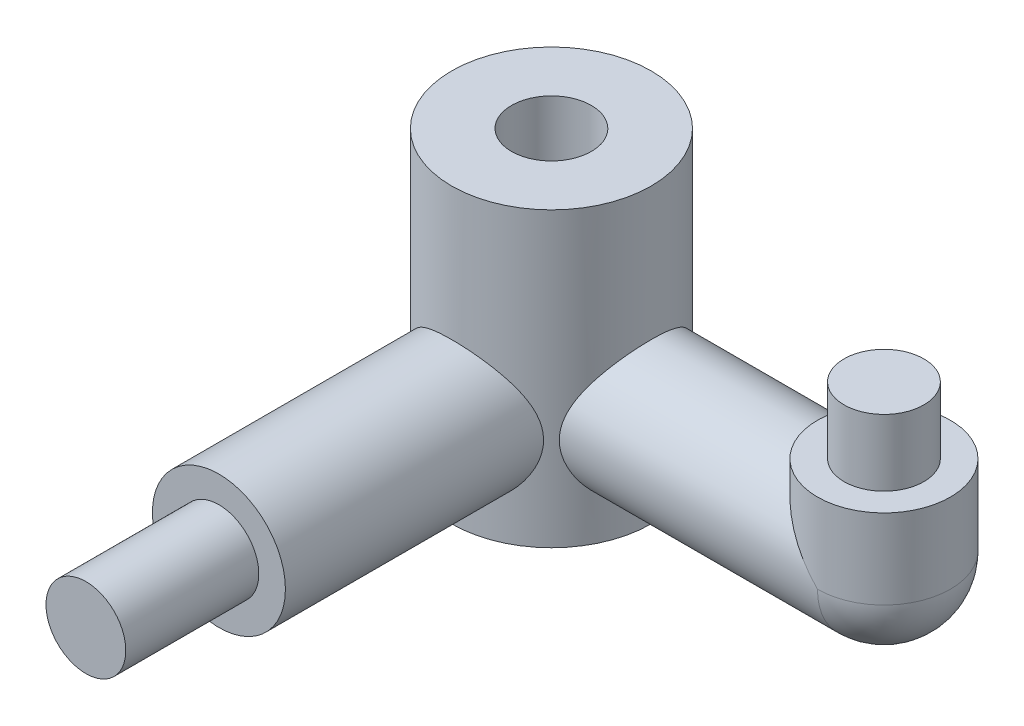
ISO-10303-21;
HEADER;
FILE_DESCRIPTION(('STEP AP214'),'2;1');
FILE_NAME('part.step','',(''),(''),'','','');
FILE_SCHEMA(('AUTOMOTIVE_DESIGN { 1 0 10303 214 1 1 1 1 }'));
ENDSEC;
DATA;
#1=APPLICATION_CONTEXT('core data for automotive mechanical design processes');
#2=APPLICATION_PROTOCOL_DEFINITION('international standard','automotive_design',2000,#1);
#3=PRODUCT_CONTEXT('',#1,'mechanical');
#4=PRODUCT('Part','Part','',(#3));
#5=PRODUCT_RELATED_PRODUCT_CATEGORY('part','',(#4));
#6=PRODUCT_DEFINITION_FORMATION('','',#4);
#7=PRODUCT_DEFINITION_CONTEXT('part definition',#1,'design');
#8=PRODUCT_DEFINITION('design','',#6,#7);
#9=PRODUCT_DEFINITION_SHAPE('','',#8);
#10=(LENGTH_UNIT() NAMED_UNIT(*) SI_UNIT(.MILLI.,.METRE.));
#11=(NAMED_UNIT(*) PLANE_ANGLE_UNIT() SI_UNIT($,.RADIAN.));
#12=(NAMED_UNIT(*) SI_UNIT($,.STERADIAN.) SOLID_ANGLE_UNIT());
#13=UNCERTAINTY_MEASURE_WITH_UNIT(LENGTH_MEASURE(1.E-05),#10,'distance_accuracy_value','');
#14=(GEOMETRIC_REPRESENTATION_CONTEXT(3) GLOBAL_UNCERTAINTY_ASSIGNED_CONTEXT((#13)) GLOBAL_UNIT_ASSIGNED_CONTEXT((#10,
#11,#12)) REPRESENTATION_CONTEXT('',''));
#15=CARTESIAN_POINT('',(0.,0.,0.));
#16=DIRECTION('',(0.,0.,1.));
#17=DIRECTION('',(1.,0.,0.));
#18=AXIS2_PLACEMENT_3D('',#15,#16,#17);
#19=CARTESIAN_POINT('',(12.5,0.,12.5));
#20=DIRECTION('',(-1.,0.,0.));
#21=DIRECTION('',(0.,0.,1.));
#22=AXIS2_PLACEMENT_3D('',#19,#20,#21);
#23=CYLINDRICAL_SURFACE('',#22,2.5);
#24=CARTESIAN_POINT('',(2.79508497187474,0.,15.));
#25=CARTESIAN_POINT('',(2.7950969200882,-0.12203539199451,14.9999931665049));
#26=CARTESIAN_POINT('',(2.80322589537915,-0.24411345591108,14.9909873720809));
#27=CARTESIAN_POINT('',(2.83414964897101,-0.483899875763707,14.955728388248));
#28=CARTESIAN_POINT('',(2.85697073274532,-0.601599992584145,14.9294442610795));
#29=CARTESIAN_POINT('',(2.91320734997137,-0.828419353679954,14.8616981434561));
#30=CARTESIAN_POINT('',(2.94651962336046,-0.937609811735505,14.8203835012304));
#31=CARTESIAN_POINT('',(3.0198010825739,-1.14733209958024,14.724175578965));
#32=CARTESIAN_POINT('',(3.0597716503108,-1.24786212533312,14.6692794789772));
#33=CARTESIAN_POINT('',(3.14932634695722,-1.45455943250844,14.5375280809408));
#34=CARTESIAN_POINT('',(3.19943844305199,-1.55916844040906,14.4585847632594));
#35=CARTESIAN_POINT('',(3.2993085952709,-1.75500009028197,14.2852484340018));
#36=CARTESIAN_POINT('',(3.34906625705619,-1.84620953563161,14.1908403828438));
#37=CARTESIAN_POINT('',(3.45111772386694,-2.02581872622303,13.9726609758867));
#38=CARTESIAN_POINT('',(3.50273966991301,-2.11190952263638,13.8466179955418));
#39=CARTESIAN_POINT('',(3.57157394366626,-2.22361921364336,13.6451778891779));
#40=CARTESIAN_POINT('',(3.59309008860164,-2.25795804914699,13.5759488861675));
#41=CARTESIAN_POINT('',(3.63262620854537,-2.32035779836937,13.4337834389538));
#42=CARTESIAN_POINT('',(3.65064878638783,-2.34842338828881,13.3608498063616));
#43=CARTESIAN_POINT('',(3.68081703547434,-2.39503483454956,13.2201878747443));
#44=CARTESIAN_POINT('',(3.69339418705367,-2.41429369051328,13.1527874998823));
#45=CARTESIAN_POINT('',(3.71495996037348,-2.44715785950365,13.0160960830364));
#46=CARTESIAN_POINT('',(3.72395078649705,-2.46076664563237,12.9468062305173));
#47=CARTESIAN_POINT('',(3.73807307002728,-2.4820867837772,12.806984183954));
#48=CARTESIAN_POINT('',(3.74320751443813,-2.48980270026053,12.7364529948307));
#49=CARTESIAN_POINT('',(3.74947194842874,-2.49920978058342,12.5948391173021));
#50=CARTESIAN_POINT('',(3.75060250301864,-2.50090179448804,12.5237565081294));
#51=CARTESIAN_POINT('',(3.7481766183866,-2.497268187649,12.3324035470292));
#52=CARTESIAN_POINT('',(3.74082418442918,-2.48625933203371,12.2122226086997));
#53=CARTESIAN_POINT('',(3.71510641212365,-2.44739053993887,11.9759283004935));
#54=CARTESIAN_POINT('',(3.69674027061221,-2.41952937452061,11.8598152279153));
#55=CARTESIAN_POINT('',(3.65065004645573,-2.34850423370375,11.63490881572));
#56=CARTESIAN_POINT('',(3.62296317883832,-2.30540108128751,11.5260883986619));
#57=CARTESIAN_POINT('',(3.56026410195281,-2.20555825858029,11.3172368829071));
#58=CARTESIAN_POINT('',(3.52525055567676,-2.14881609909554,11.2172073931589));
#59=CARTESIAN_POINT('',(3.44522563575143,-2.01502647807678,11.0146451731761));
#60=CARTESIAN_POINT('',(3.39950508433781,-1.9362905688413,10.9135107937325));
#61=CARTESIAN_POINT('',(3.30500754843975,-1.76512667765928,10.7250147610667));
#62=CARTESIAN_POINT('',(3.25622591750128,-1.67267757529536,10.6376747895437));
#63=CARTESIAN_POINT('',(3.15187555335589,-1.46004597832327,10.4653471063237));
#64=CARTESIAN_POINT('',(3.09642899787461,-1.33778614799763,10.3828300986032));
#65=CARTESIAN_POINT('',(2.99344513762195,-1.07811270332939,10.2395640505202));
#66=CARTESIAN_POINT('',(2.9458946446941,-0.940725007515723,10.1787785139508));
#67=CARTESIAN_POINT('',(2.87828587847298,-0.694101172027533,10.0958409449494));
#68=CARTESIAN_POINT('',(2.85425455711664,-0.588008287325482,10.0676151037051));
#69=CARTESIAN_POINT('',(2.81761299747417,-0.371200637832196,10.0252555547016));
#70=CARTESIAN_POINT('',(2.80498295983327,-0.260494236067081,10.0110974127934));
#71=CARTESIAN_POINT('',(2.79309446228807,-0.0369462669151342,9.99775749829134));
#72=CARTESIAN_POINT('',(2.79389417321902,0.07590247317829,9.99864087814375));
#73=CARTESIAN_POINT('',(2.80887350472385,0.299604792415647,10.0154796284879));
#74=CARTESIAN_POINT('',(2.82306397100443,0.410456680054604,10.0314472162926));
#75=CARTESIAN_POINT('',(2.86159971838753,0.621736772028094,10.0762523602389));
#76=CARTESIAN_POINT('',(2.8854148370185,0.722409636552731,10.1044228186196));
#77=CARTESIAN_POINT('',(2.94037448030346,0.917657795357689,10.1722119798831));
#78=CARTESIAN_POINT('',(2.97152146578388,1.01223102878522,10.2118345275002));
#79=CARTESIAN_POINT('',(3.04514354542651,1.21275250469898,10.3104581674188));
#80=CARTESIAN_POINT('',(3.08863851805688,1.31719601439857,10.3717496397485));
#81=CARTESIAN_POINT('',(3.17828143495483,1.51552100330145,10.5080908562554));
#82=CARTESIAN_POINT('',(3.22443256180687,1.60938939593678,10.583157351459));
#83=CARTESIAN_POINT('',(3.32594597905818,1.8049529343238,10.7640417785862));
#84=CARTESIAN_POINT('',(3.38111815174429,1.90387856030757,10.8729951685702));
#85=CARTESIAN_POINT('',(3.48469477300836,2.08227085367818,11.1086256391745));
#86=CARTESIAN_POINT('',(3.53310518486529,2.16175471407159,11.2352869031793));
#87=CARTESIAN_POINT('',(3.60988526553013,2.28486467364644,11.4781406564723));
#88=CARTESIAN_POINT('',(3.64031822638823,2.33244563055031,11.591672043892));
#89=CARTESIAN_POINT('',(3.69098384833738,2.4107589929007,11.8265536512245));
#90=CARTESIAN_POINT('',(3.71122512339974,2.44150562857475,11.9478971701766));
#91=CARTESIAN_POINT('',(3.7397295503345,2.4846212047984,12.1957882596207));
#92=CARTESIAN_POINT('',(3.7479393857067,2.49690834938333,12.3223564538446));
#93=CARTESIAN_POINT('',(3.75137276286315,2.50205981427139,12.5760694332259));
#94=CARTESIAN_POINT('',(3.74659751173625,2.49492593994523,12.7032141636918));
#95=CARTESIAN_POINT('',(3.72536944971656,2.46292563874411,12.9446969156601));
#96=CARTESIAN_POINT('',(3.70979096512321,2.43938626892272,13.0592939288381));
#97=CARTESIAN_POINT('',(3.66920132758664,2.3772024882114,13.2825230287464));
#98=CARTESIAN_POINT('',(3.64418870933873,2.33855573081601,13.3911541858588));
#99=CARTESIAN_POINT('',(3.58489706857748,2.24507661889487,13.6064341207602));
#100=CARTESIAN_POINT('',(3.55016561182942,2.18943711563077,13.7126044864994));
#101=CARTESIAN_POINT('',(3.4746926029432,2.06481169421789,13.9144408283549));
#102=CARTESIAN_POINT('',(3.43394745806505,1.99581779006139,14.010100465066));
#103=CARTESIAN_POINT('',(3.34241164340578,1.834213872078,14.2041177775135));
#104=CARTESIAN_POINT('',(3.29104892347055,1.73959622040098,14.3005334940601));
#105=CARTESIAN_POINT('',(3.18816697061515,1.53610807307418,14.477000278536));
#106=CARTESIAN_POINT('',(3.13664764961408,1.42722701398168,14.5570391041094));
#107=CARTESIAN_POINT('',(3.04230266989059,1.20516551153345,14.6939156689244));
#108=CARTESIAN_POINT('',(2.99911358431654,1.09294773748127,14.7520580860144));
#109=CARTESIAN_POINT('',(2.92184376984512,0.858394438839195,14.8514475294537));
#110=CARTESIAN_POINT('',(2.88774539103267,0.736079132972223,14.8927273792616));
#111=CARTESIAN_POINT('',(2.83988814924271,0.511535664235876,14.9492032803065));
#112=CARTESIAN_POINT('',(2.8232961930402,0.410864703230722,14.9681528527247));
#113=CARTESIAN_POINT('',(2.80089398978714,0.206804500150087,14.9935489496758));
#114=CARTESIAN_POINT('',(2.79507484649051,0.103417572562972,15.0000057909715));
#115=CARTESIAN_POINT('',(2.79508497187474,0.,15.));
#116=B_SPLINE_CURVE_WITH_KNOTS('',3,(#24,#25,#26,#27,#28,#29,#30,#31,#32,#33,#34,#35,#36,#37,
#38,#39,#40,#41,#42,#43,#44,#45,#46,#47,#48,#49,#50,#51,#52,#53,#54,#55,#56,#57,#58,#59,#60,#61,
#62,#63,#64,#65,#66,#67,#68,#69,#70,#71,#72,#73,#74,#75,#76,#77,#78,#79,#80,#81,#82,#83,#84,#85,
#86,#87,#88,#89,#90,#91,#92,#93,#94,#95,#96,#97,#98,#99,#100,#101,#102,#103,#104,#105,#106,#107,
#108,#109,#110,#111,#112,#113,#114,#115),.UNSPECIFIED.,.T.,.F.,(4,2,2,2,2,2,2,2,2,2,2,2,2,2,2,2,
2,2,2,2,2,2,2,2,2,2,2,2,2,2,2,2,2,2,2,2,2,2,2,2,2,2,2,2,2,4),(0.,0.365633663402691,
0.73192380282411,1.09471581402034,1.45758321583186,1.87693346336045,2.29669398044776,
2.77708788757294,3.01741038242227,3.25755313426637,3.4708854816433,3.68408649861694,
3.8971222075393,4.11012785266349,4.47091533100653,4.83172912260658,5.19111904372464,
5.55057460534726,5.95726521839269,6.36458882901773,6.83515493787155,7.30492701585911,
7.64074727407631,7.97598322200334,8.31267161453521,8.64963293869222,8.97012679044332,
9.29072836470578,9.67541151979821,10.0605656041627,10.5298547006558,10.9987272763011,
11.37755340179,11.7560588052497,12.1362365099709,12.5163788747206,12.8688809222654,
13.2214377428043,13.5943944314676,13.9675748432824,14.3994487227002,14.8316442743764,
15.2308477166028,15.6292703522591,15.939378847947,16.2492311399617),.UNSPECIFIED.);
#117=CARTESIAN_POINT('',(2.79508497187474,0.,15.));
#118=VERTEX_POINT('',#117);
#119=EDGE_CURVE('E109',#118,#118,#116,.T.);
#120=ORIENTED_EDGE('',*,*,#119,.T.);
#121=EDGE_LOOP('',(#120));
#122=FACE_BOUND('',#121,.T.);
#123=CARTESIAN_POINT('',(12.5,0.,12.5));
#124=DIRECTION('',(-0.707106781186547,-0.707106781186547,0.));
#125=DIRECTION('',(-0.707106781186547,0.707106781186547,0.));
#126=AXIS2_PLACEMENT_3D('',#123,#124,#125);
#127=ELLIPSE('',#126,3.53553390593274,2.5);
#128=CARTESIAN_POINT('',(12.5,0.,10.));
#129=VERTEX_POINT('',#128);
#130=CARTESIAN_POINT('',(12.5,0.,15.));
#131=VERTEX_POINT('',#130);
#132=EDGE_CURVE('E63',#129,#131,#127,.F.);
#133=ORIENTED_EDGE('',*,*,#132,.F.);
#134=CARTESIAN_POINT('',(12.5,0.,12.5));
#135=DIRECTION('',(1.,0.,0.));
#136=DIRECTION('',(0.,0.,-1.));
#137=AXIS2_PLACEMENT_3D('',#134,#135,#136);
#138=CIRCLE('',#137,2.5);
#139=EDGE_CURVE('E53',#131,#129,#138,.T.);
#140=ORIENTED_EDGE('',*,*,#139,.F.);
#141=EDGE_LOOP('',(#133,#140));
#142=FACE_BOUND('',#141,.T.);
#143=ADVANCED_FACE('F37',(#122,#142),#23,.T.);
#144=CARTESIAN_POINT('',(12.5,3.,12.5));
#145=DIRECTION('',(0.,-1.,0.));
#146=DIRECTION('',(0.,0.,-1.));
#147=AXIS2_PLACEMENT_3D('',#144,#145,#146);
#148=CYLINDRICAL_SURFACE('',#147,2.5);
#149=CARTESIAN_POINT('',(12.5,3.,12.5));
#150=DIRECTION('',(0.,1.,0.));
#151=DIRECTION('',(0.,0.,1.));
#152=AXIS2_PLACEMENT_3D('',#149,#150,#151);
#153=CIRCLE('',#152,2.5);
#154=CARTESIAN_POINT('',(12.5,3.,15.));
#155=VERTEX_POINT('',#154);
#156=EDGE_CURVE('E60',#155,#155,#153,.T.);
#157=ORIENTED_EDGE('',*,*,#156,.F.);
#158=EDGE_LOOP('',(#157));
#159=FACE_BOUND('',#158,.T.);
#160=CARTESIAN_POINT('',(12.5,0.,12.5));
#161=DIRECTION('',(0.,1.,0.));
#162=DIRECTION('',(0.,0.,1.));
#163=AXIS2_PLACEMENT_3D('',#160,#161,#162);
#164=CIRCLE('',#163,2.5);
#165=EDGE_CURVE('E55',#131,#129,#164,.T.);
#166=ORIENTED_EDGE('',*,*,#165,.T.);
#167=ORIENTED_EDGE('',*,*,#132,.T.);
#168=EDGE_LOOP('',(#166,#167));
#169=FACE_BOUND('',#168,.T.);
#170=ADVANCED_FACE('F64',(#159,#169),#148,.T.);
#171=CARTESIAN_POINT('',(12.5,3.,12.5));
#172=DIRECTION('',(0.,1.,0.));
#173=DIRECTION('',(0.,0.,1.));
#174=AXIS2_PLACEMENT_3D('',#171,#172,#173);
#175=PLANE('',#174);
#176=CARTESIAN_POINT('',(12.5,3.,12.5));
#177=DIRECTION('',(0.,1.,0.));
#178=DIRECTION('',(0.,0.,1.));
#179=AXIS2_PLACEMENT_3D('',#176,#177,#178);
#180=CIRCLE('',#179,1.5);
#181=CARTESIAN_POINT('',(12.5,3.,14.));
#182=VERTEX_POINT('',#181);
#183=EDGE_CURVE('E46',#182,#182,#180,.T.);
#184=ORIENTED_EDGE('',*,*,#183,.F.);
#185=EDGE_LOOP('',(#184));
#186=FACE_BOUND('',#185,.T.);
#187=ORIENTED_EDGE('',*,*,#156,.T.);
#188=EDGE_LOOP('',(#187));
#189=FACE_BOUND('',#188,.T.);
#190=ADVANCED_FACE('F105',(#186,#189),#175,.T.);
#191=CARTESIAN_POINT('',(12.5,5.5,12.5));
#192=DIRECTION('',(0.,-1.,0.));
#193=DIRECTION('',(0.,0.,-1.));
#194=AXIS2_PLACEMENT_3D('',#191,#192,#193);
#195=CYLINDRICAL_SURFACE('',#194,1.5);
#196=CARTESIAN_POINT('',(12.5,5.5,12.5));
#197=DIRECTION('',(0.,1.,0.));
#198=DIRECTION('',(0.,0.,1.));
#199=AXIS2_PLACEMENT_3D('',#196,#197,#198);
#200=CIRCLE('',#199,1.5);
#201=CARTESIAN_POINT('',(12.5,5.5,14.));
#202=VERTEX_POINT('',#201);
#203=EDGE_CURVE('E61',#202,#202,#200,.T.);
#204=ORIENTED_EDGE('',*,*,#203,.F.);
#205=EDGE_LOOP('',(#204));
#206=FACE_BOUND('',#205,.T.);
#207=ORIENTED_EDGE('',*,*,#183,.T.);
#208=EDGE_LOOP('',(#207));
#209=FACE_BOUND('',#208,.T.);
#210=ADVANCED_FACE('F126',(#206,#209),#195,.T.);
#211=CARTESIAN_POINT('',(12.5,5.5,12.5));
#212=DIRECTION('',(0.,1.,0.));
#213=DIRECTION('',(0.,0.,1.));
#214=AXIS2_PLACEMENT_3D('',#211,#212,#213);
#215=PLANE('',#214);
#216=ORIENTED_EDGE('',*,*,#203,.T.);
#217=EDGE_LOOP('',(#216));
#218=FACE_BOUND('',#217,.T.);
#219=ADVANCED_FACE('F132',(#218),#215,.T.);
#220=CARTESIAN_POINT('',(12.5,0.,12.5));
#221=DIRECTION('',(0.,0.,1.));
#222=DIRECTION('',(0.,-1.,0.));
#223=AXIS2_PLACEMENT_3D('',#220,#221,#222);
#224=SPHERICAL_SURFACE('',#223,2.5);
#225=ORIENTED_EDGE('',*,*,#165,.F.);
#226=ORIENTED_EDGE('',*,*,#139,.T.);
#227=EDGE_LOOP('',(#225,#226));
#228=FACE_BOUND('',#227,.T.);
#229=ADVANCED_FACE('F57',(#228),#224,.T.);
#230=CARTESIAN_POINT('',(0.,-3.5,12.5));
#231=DIRECTION('',(0.,1.,0.));
#232=DIRECTION('',(0.,0.,1.));
#233=AXIS2_PLACEMENT_3D('',#230,#231,#232);
#234=CYLINDRICAL_SURFACE('',#233,3.75);
#235=CARTESIAN_POINT('',(0.,7.5,12.5));
#236=DIRECTION('',(0.,1.,0.));
#237=DIRECTION('',(0.,0.,1.));
#238=AXIS2_PLACEMENT_3D('',#235,#236,#237);
#239=CIRCLE('',#238,3.75);
#240=CARTESIAN_POINT('',(0.,7.5,16.25));
#241=VERTEX_POINT('',#240);
#242=EDGE_CURVE('E41',#241,#241,#239,.T.);
#243=ORIENTED_EDGE('',*,*,#242,.F.);
#244=EDGE_LOOP('',(#243));
#245=FACE_BOUND('',#244,.T.);
#246=CARTESIAN_POINT('',(0.,-3.5,12.5));
#247=DIRECTION('',(0.,1.,0.));
#248=DIRECTION('',(0.,0.,1.));
#249=AXIS2_PLACEMENT_3D('',#246,#247,#248);
#250=CIRCLE('',#249,3.75);
#251=CARTESIAN_POINT('',(0.,-3.5,16.25));
#252=VERTEX_POINT('',#251);
#253=EDGE_CURVE('E111',#252,#252,#250,.T.);
#254=ORIENTED_EDGE('',*,*,#253,.T.);
#255=EDGE_LOOP('',(#254));
#256=FACE_BOUND('',#255,.T.);
#257=CARTESIAN_POINT('',(0.,-2.5,16.25));
#258=CARTESIAN_POINT('',(0.125601374662479,-2.49999844522486,16.2499987655971));
#259=CARTESIAN_POINT('',(0.251210147375107,-2.49048193681508,16.2436345641389));
#260=CARTESIAN_POINT('',(0.498417534655945,-2.45300452089374,16.2188086257994));
#261=CARTESIAN_POINT('',(0.620014216592752,-2.42503485682461,16.2003411455889));
#262=CARTESIAN_POINT('',(0.855265062174911,-2.35236519336202,16.15313090482));
#263=CARTESIAN_POINT('',(0.968953504127328,-2.3077435320027,16.1244362850146));
#264=CARTESIAN_POINT('',(1.18676920045378,-2.20367083890425,16.0590767571248));
#265=CARTESIAN_POINT('',(1.29089506362946,-2.14421765408286,16.0224106919304));
#266=CARTESIAN_POINT('',(1.49660584979873,-2.00667881531738,15.940341606967));
#267=CARTESIAN_POINT('',(1.59722537477683,-1.92744017057614,15.8944612170053));
#268=CARTESIAN_POINT('',(1.78466006292512,-1.75533744267723,15.7997789162835));
#269=CARTESIAN_POINT('',(1.87145507131621,-1.66245383870328,15.7509728802437));
#270=CARTESIAN_POINT('',(2.0427787194828,-1.44868453932588,15.646603307578));
#271=CARTESIAN_POINT('',(2.12478982891588,-1.32569293318891,15.5911883489815));
#272=CARTESIAN_POINT('',(2.2668794632946,-1.06454577824808,15.4885518421507));
#273=CARTESIAN_POINT('',(2.32699591797102,-0.926416998116225,15.4413161994906));
#274=CARTESIAN_POINT('',(2.40842543754358,-0.679110883173427,15.3747033329775));
#275=CARTESIAN_POINT('',(2.43593059042227,-0.573089433892985,15.3512203486373));
#276=CARTESIAN_POINT('',(2.47688272234313,-0.356569369087547,15.3157246207628));
#277=CARTESIAN_POINT('',(2.4903539331615,-0.246078814101425,15.3036921093321));
#278=CARTESIAN_POINT('',(2.50239205175333,-0.0231565264203779,15.2929575700702));
#279=CARTESIAN_POINT('',(2.50089803644892,0.0892812793369942,15.2943100318775));
#280=CARTESIAN_POINT('',(2.48296976668709,0.31204371685318,15.3102471936467));
#281=CARTESIAN_POINT('',(2.46652285482348,0.42236647745813,15.3248431039713));
#282=CARTESIAN_POINT('',(2.42081242764785,0.633083814140614,15.3640898245089));
#283=CARTESIAN_POINT('',(2.39214639324732,0.733701670220431,15.3882686027157));
#284=CARTESIAN_POINT('',(2.32337648204614,0.928779614013202,15.4438702853161));
#285=CARTESIAN_POINT('',(2.28326884153759,1.02323766287964,15.4752955727905));
#286=CARTESIAN_POINT('',(2.1834227342476,1.22378174408541,15.5495524551959));
#287=CARTESIAN_POINT('',(2.12135065377971,1.32832487557415,15.5934039718851));
#288=CARTESIAN_POINT('',(1.98336200545358,1.52672924413694,15.6836442215406));
#289=CARTESIAN_POINT('',(1.90742836248812,1.62057707221127,15.7300360338294));
#290=CARTESIAN_POINT('',(1.72476456653743,1.81567818199372,15.8317917970917));
#291=CARTESIAN_POINT('',(1.61492422854798,1.91416756085065,15.886934309019));
#292=CARTESIAN_POINT('',(1.37750999884782,2.09149561817591,15.9902262583031));
#293=CARTESIAN_POINT('',(1.24995287417907,2.1703526817619,16.0383822205976));
#294=CARTESIAN_POINT('',(1.0060722838711,2.29184714827804,16.1143175511319));
#295=CARTESIAN_POINT('',(0.892447054215007,2.33855420417353,16.1442407645699));
#296=CARTESIAN_POINT('',(0.657545054919234,2.41513115703185,16.1938464878806));
#297=CARTESIAN_POINT('',(0.536274848752031,2.44501528391531,16.2135376515941));
#298=CARTESIAN_POINT('',(0.288731816465385,2.48645145654745,16.2409485269603));
#299=CARTESIAN_POINT('',(0.162439764917712,2.49792432617282,16.2486165307649));
#300=CARTESIAN_POINT('',(-0.0905518992366956,2.50155886070277,16.2510389370643));
#301=CARTESIAN_POINT('',(-0.217251482733301,2.49372187561097,16.2457942423204));
#302=CARTESIAN_POINT('',(-0.458069646505276,2.46046993054755,16.2237448678034));
#303=CARTESIAN_POINT('',(-0.572446805848922,2.43632837780595,16.2077780798778));
#304=CARTESIAN_POINT('',(-0.795145490534314,2.37300539248395,16.1664806160604));
#305=CARTESIAN_POINT('',(-0.903466046964158,2.33382156133983,16.1411484468373));
#306=CARTESIAN_POINT('',(-1.11833093808224,2.23918462869375,16.0812044066145));
#307=CARTESIAN_POINT('',(-1.22437023078828,2.18288980739732,16.0461233766975));
#308=CARTESIAN_POINT('',(-1.4258537799476,2.05695838756752,15.9700231951437));
#309=CARTESIAN_POINT('',(-1.52129143525484,1.98731354933614,15.9290003800486));
#310=CARTESIAN_POINT('',(-1.71481806852475,1.82424016480155,15.8369318331687));
#311=CARTESIAN_POINT('',(-1.81093984460234,1.72879217489989,15.7853269600053));
#312=CARTESIAN_POINT('',(-1.98667460088534,1.52361071255986,15.6821396635712));
#313=CARTESIAN_POINT('',(-2.06627617078,1.41386745113909,15.6305572802108));
#314=CARTESIAN_POINT('',(-2.20155970680725,1.19107198401835,15.5367459871435));
#315=CARTESIAN_POINT('',(-2.25869545135382,1.07908495809515,15.4940949628616));
#316=CARTESIAN_POINT('',(-2.35620267196513,0.845159184522405,15.4179871782867));
#317=CARTESIAN_POINT('',(-2.39660432181497,0.723238827405311,15.3845139064732));
#318=CARTESIAN_POINT('',(-2.4529480426708,0.4942943907711,15.3366651024056));
#319=CARTESIAN_POINT('',(-2.47198246736887,0.38853523685261,15.3199374756853));
#320=CARTESIAN_POINT('',(-2.49624007624869,0.174283399153524,15.2984933300609));
#321=CARTESIAN_POINT('',(-2.50147826174327,0.0657938140457802,15.2937637652947));
#322=CARTESIAN_POINT('',(-2.49779901658417,-0.150803823876529,15.2970525159287));
#323=CARTESIAN_POINT('',(-2.48887320407014,-0.258911612805892,15.3050783796414));
#324=CARTESIAN_POINT('',(-2.45746249587724,-0.471679399561639,15.3326306492378));
#325=CARTESIAN_POINT('',(-2.434959510753,-0.576334600816585,15.3521723974146));
#326=CARTESIAN_POINT('',(-2.36991280115224,-0.807139035613925,15.4065855762677));
#327=CARTESIAN_POINT('',(-2.32362673285444,-0.931584861404642,15.4441542848389));
#328=CARTESIAN_POINT('',(-2.21355718508726,-1.16935832244442,15.5277768987025));
#329=CARTESIAN_POINT('',(-2.14974913954079,-1.28267004238519,15.5738426870384));
#330=CARTESIAN_POINT('',(-2.0049761800668,-1.49910320413462,15.67021527416));
#331=CARTESIAN_POINT('',(-1.9237201109137,-1.60200161476858,15.7205840067264));
#332=CARTESIAN_POINT('',(-1.74590586583933,-1.79414991385585,15.8203521043894));
#333=CARTESIAN_POINT('',(-1.64934300170333,-1.88339560419928,15.8697511672659));
#334=CARTESIAN_POINT('',(-1.4267842240515,-2.05840372944205,15.9704015102304));
#335=CARTESIAN_POINT('',(-1.29855304909225,-2.14182743680491,16.0209008750812));
#336=CARTESIAN_POINT('',(-1.09415972519334,-2.24916610728731,16.0875449862693));
#337=CARTESIAN_POINT('',(-1.0240248219925,-2.28197827055557,16.1082413600904));
#338=CARTESIAN_POINT('',(-0.880185986539607,-2.34122204927387,16.1459974834269));
#339=CARTESIAN_POINT('',(-0.806483318581937,-2.36765590539212,16.1630585097751));
#340=CARTESIAN_POINT('',(-0.614355982978064,-2.42641240787363,16.2012464376487));
#341=CARTESIAN_POINT('',(-0.49378205795347,-2.45388054231437,16.2193870411194));
#342=CARTESIAN_POINT('',(-0.248805876173038,-2.49066829102143,16.243759960404));
#343=CARTESIAN_POINT('',(-0.124406567070927,-2.50000153998504,16.2500012226604));
#344=CARTESIAN_POINT('',(0.,-2.5,16.25));
#345=B_SPLINE_CURVE_WITH_KNOTS('',3,(#257,#258,#259,#260,#261,#262,#263,#264,#265,#266,#267,
#268,#269,#270,#271,#272,#273,#274,#275,#276,#277,#278,#279,#280,#281,#282,#283,#284,#285,#286,
#287,#288,#289,#290,#291,#292,#293,#294,#295,#296,#297,#298,#299,#300,#301,#302,#303,#304,#305,
#306,#307,#308,#309,#310,#311,#312,#313,#314,#315,#316,#317,#318,#319,#320,#321,#322,#323,#324,
#325,#326,#327,#328,#329,#330,#331,#332,#333,#334,#335,#336,#337,#338,#339,#340,#341,#342,#343,
#344),.UNSPECIFIED.,.T.,.F.,(4,2,2,2,2,2,2,2,2,2,2,2,2,2,2,2,2,2,2,2,2,2,2,2,2,2,2,2,2,2,2,2,2,
2,2,2,2,2,2,2,2,2,2,4),(0.,0.376316533131749,0.75281176793586,1.12755769148779,1.50235804834233,
1.90896286250696,2.31615514505398,2.78758354119978,3.25819131806798,3.59292117095036,
3.92707209807261,4.26258389669222,4.5983799657919,4.91936077752085,5.24044729764504,
5.62684468334247,6.01372129733227,6.48398693129096,6.95381050384858,7.33155109629103,
7.70897168936672,8.08801104125969,8.46702389424924,8.81941355998746,9.17185943930993,
9.5456543354505,9.9196806868966,10.3528522018477,10.7863219147785,11.1831241913875,
11.5792078330906,11.9040506002832,12.2285400042452,12.5532215036384,12.8783365482365,
13.290082608884,13.702408917306,14.1222405651376,14.5422010497084,15.0224418945669,
15.2625373178026,15.5025482734883,15.8755655835623,16.2483023322226),.UNSPECIFIED.);
#346=CARTESIAN_POINT('',(0.,-2.5,16.25));
#347=VERTEX_POINT('',#346);
#348=EDGE_CURVE('E11',#347,#347,#345,.T.);
#349=ORIENTED_EDGE('',*,*,#348,.F.);
#350=EDGE_LOOP('',(#349));
#351=FACE_BOUND('',#350,.T.);
#352=ORIENTED_EDGE('',*,*,#119,.F.);
#353=EDGE_LOOP('',(#352));
#354=FACE_BOUND('',#353,.T.);
#355=ADVANCED_FACE('F76',(#245,#256,#351,#354),#234,.T.);
#356=CARTESIAN_POINT('',(0.,-3.5,12.5));
#357=DIRECTION('',(0.,1.,0.));
#358=DIRECTION('',(0.,0.,1.));
#359=AXIS2_PLACEMENT_3D('',#356,#357,#358);
#360=PLANE('',#359);
#361=CARTESIAN_POINT('',(0.,-3.5,12.5));
#362=DIRECTION('',(0.,1.,0.));
#363=DIRECTION('',(0.,0.,1.));
#364=AXIS2_PLACEMENT_3D('',#361,#362,#363);
#365=CIRCLE('',#364,1.5);
#366=CARTESIAN_POINT('',(0.,-3.5,14.));
#367=VERTEX_POINT('',#366);
#368=EDGE_CURVE('E201',#367,#367,#365,.T.);
#369=ORIENTED_EDGE('',*,*,#368,.T.);
#370=EDGE_LOOP('',(#369));
#371=FACE_BOUND('',#370,.T.);
#372=ORIENTED_EDGE('',*,*,#253,.F.);
#373=EDGE_LOOP('',(#372));
#374=FACE_BOUND('',#373,.T.);
#375=ADVANCED_FACE('F90',(#371,#374),#360,.F.);
#376=CARTESIAN_POINT('',(0.,7.5,12.5));
#377=DIRECTION('',(0.,1.,0.));
#378=DIRECTION('',(0.,0.,1.));
#379=AXIS2_PLACEMENT_3D('',#376,#377,#378);
#380=PLANE('',#379);
#381=CARTESIAN_POINT('',(0.,7.5,12.5));
#382=DIRECTION('',(0.,1.,0.));
#383=DIRECTION('',(0.,0.,1.));
#384=AXIS2_PLACEMENT_3D('',#381,#382,#383);
#385=CIRCLE('',#384,1.5);
#386=CARTESIAN_POINT('',(0.,7.5,14.));
#387=VERTEX_POINT('',#386);
#388=EDGE_CURVE('E75',#387,#387,#385,.T.);
#389=ORIENTED_EDGE('',*,*,#388,.F.);
#390=EDGE_LOOP('',(#389));
#391=FACE_BOUND('',#390,.T.);
#392=ORIENTED_EDGE('',*,*,#242,.T.);
#393=EDGE_LOOP('',(#392));
#394=FACE_BOUND('',#393,.T.);
#395=ADVANCED_FACE('F86',(#391,#394),#380,.T.);
#396=CARTESIAN_POINT('',(0.,0.,12.5));
#397=DIRECTION('',(0.,0.,1.));
#398=DIRECTION('',(1.,0.,0.));
#399=AXIS2_PLACEMENT_3D('',#396,#397,#398);
#400=CYLINDRICAL_SURFACE('',#399,2.5);
#401=ORIENTED_EDGE('',*,*,#348,.T.);
#402=EDGE_LOOP('',(#401));
#403=FACE_BOUND('',#402,.T.);
#404=CARTESIAN_POINT('',(0.,0.,25.));
#405=DIRECTION('',(0.,0.,1.));
#406=DIRECTION('',(1.,0.,0.));
#407=AXIS2_PLACEMENT_3D('',#404,#405,#406);
#408=CIRCLE('',#407,2.5);
#409=CARTESIAN_POINT('',(2.5,0.,25.));
#410=VERTEX_POINT('',#409);
#411=EDGE_CURVE('E208',#410,#410,#408,.T.);
#412=ORIENTED_EDGE('',*,*,#411,.F.);
#413=EDGE_LOOP('',(#412));
#414=FACE_BOUND('',#413,.T.);
#415=ADVANCED_FACE('F80',(#403,#414),#400,.T.);
#416=CARTESIAN_POINT('',(0.,0.,25.));
#417=DIRECTION('',(0.,0.,-1.));
#418=DIRECTION('',(1.,0.,0.));
#419=AXIS2_PLACEMENT_3D('',#416,#417,#418);
#420=PLANE('',#419);
#421=CARTESIAN_POINT('',(0.,0.,25.));
#422=DIRECTION('',(0.,0.,-1.));
#423=DIRECTION('',(-1.,0.,0.));
#424=AXIS2_PLACEMENT_3D('',#421,#422,#423);
#425=CIRCLE('',#424,1.5);
#426=CARTESIAN_POINT('',(-1.5,0.,25.));
#427=VERTEX_POINT('',#426);
#428=EDGE_CURVE('E203',#427,#427,#425,.T.);
#429=ORIENTED_EDGE('',*,*,#428,.T.);
#430=EDGE_LOOP('',(#429));
#431=FACE_BOUND('',#430,.T.);
#432=ORIENTED_EDGE('',*,*,#411,.T.);
#433=EDGE_LOOP('',(#432));
#434=FACE_BOUND('',#433,.T.);
#435=ADVANCED_FACE('F85',(#431,#434),#420,.F.);
#436=CARTESIAN_POINT('',(0.,0.,30.));
#437=DIRECTION('',(0.,0.,-1.));
#438=DIRECTION('',(-1.,0.,0.));
#439=AXIS2_PLACEMENT_3D('',#436,#437,#438);
#440=CYLINDRICAL_SURFACE('',#439,1.5);
#441=CARTESIAN_POINT('',(0.,0.,30.));
#442=DIRECTION('',(0.,0.,-1.));
#443=DIRECTION('',(-1.,0.,0.));
#444=AXIS2_PLACEMENT_3D('',#441,#442,#443);
#445=CIRCLE('',#444,1.5);
#446=CARTESIAN_POINT('',(-1.5,0.,30.));
#447=VERTEX_POINT('',#446);
#448=EDGE_CURVE('E205',#447,#447,#445,.T.);
#449=ORIENTED_EDGE('',*,*,#448,.T.);
#450=EDGE_LOOP('',(#449));
#451=FACE_BOUND('',#450,.T.);
#452=ORIENTED_EDGE('',*,*,#428,.F.);
#453=EDGE_LOOP('',(#452));
#454=FACE_BOUND('',#453,.T.);
#455=ADVANCED_FACE('F178',(#451,#454),#440,.T.);
#456=CARTESIAN_POINT('',(0.,0.,30.));
#457=DIRECTION('',(0.,0.,1.));
#458=DIRECTION('',(-1.,0.,0.));
#459=AXIS2_PLACEMENT_3D('',#456,#457,#458);
#460=PLANE('',#459);
#461=ORIENTED_EDGE('',*,*,#448,.F.);
#462=EDGE_LOOP('',(#461));
#463=FACE_BOUND('',#462,.T.);
#464=ADVANCED_FACE('F185',(#463),#460,.T.);
#465=CARTESIAN_POINT('',(0.,-3.5,12.5));
#466=DIRECTION('',(0.,1.,0.));
#467=DIRECTION('',(0.,0.,1.));
#468=AXIS2_PLACEMENT_3D('',#465,#466,#467);
#469=CYLINDRICAL_SURFACE('',#468,1.5);
#470=ORIENTED_EDGE('',*,*,#388,.T.);
#471=EDGE_LOOP('',(#470));
#472=FACE_BOUND('',#471,.T.);
#473=ORIENTED_EDGE('',*,*,#368,.F.);
#474=EDGE_LOOP('',(#473));
#475=FACE_BOUND('',#474,.T.);
#476=ADVANCED_FACE('F156',(#472,#475),#469,.F.);
#477=CLOSED_SHELL('',(#143,#170,#190,#210,#219,#229,#355,#375,#395,#415,#435,#455,#464,#476));
#478=MANIFOLD_SOLID_BREP('B2',#477);
#479=ADVANCED_BREP_SHAPE_REPRESENTATION('',(#18,#478),#14);
#480=SHAPE_DEFINITION_REPRESENTATION(#9,#479);
ENDSEC;
END-ISO-10303-21;
